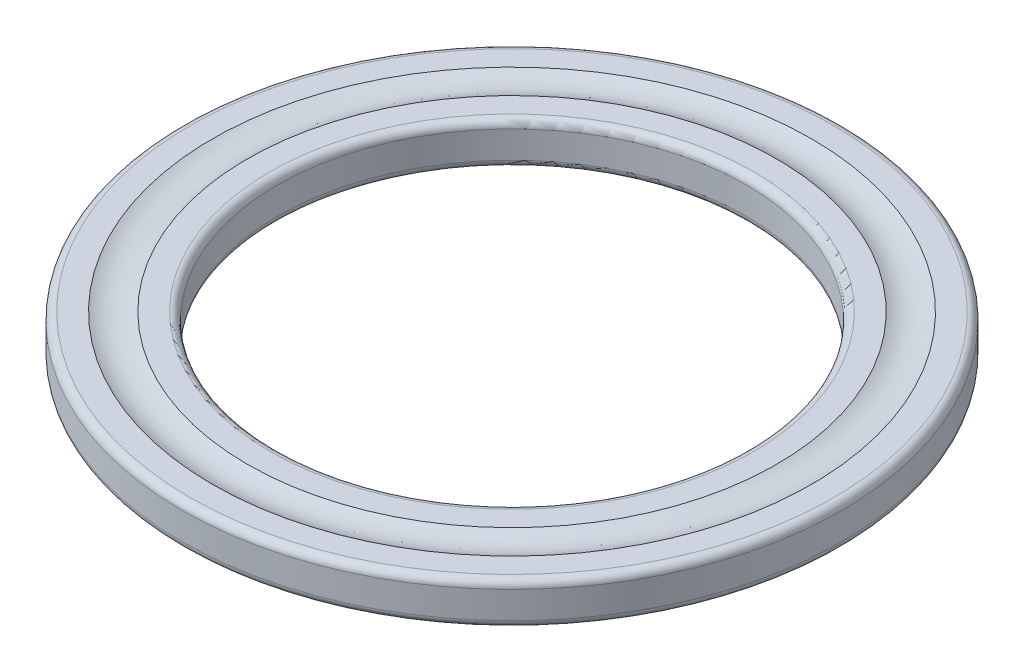
ISO-10303-21;
HEADER;
FILE_DESCRIPTION(('STEP AP214'),'2;1');
FILE_NAME('part.step','',(''),(''),'','','');
FILE_SCHEMA(('AUTOMOTIVE_DESIGN { 1 0 10303 214 1 1 1 1 }'));
ENDSEC;
DATA;
#1=APPLICATION_CONTEXT('core data for automotive mechanical design processes');
#2=APPLICATION_PROTOCOL_DEFINITION('international standard','automotive_design',2000,#1);
#3=PRODUCT_CONTEXT('',#1,'mechanical');
#4=PRODUCT('Part','Part','',(#3));
#5=PRODUCT_RELATED_PRODUCT_CATEGORY('part','',(#4));
#6=PRODUCT_DEFINITION_FORMATION('','',#4);
#7=PRODUCT_DEFINITION_CONTEXT('part definition',#1,'design');
#8=PRODUCT_DEFINITION('design','',#6,#7);
#9=PRODUCT_DEFINITION_SHAPE('','',#8);
#10=(LENGTH_UNIT() NAMED_UNIT(*) SI_UNIT(.MILLI.,.METRE.));
#11=(NAMED_UNIT(*) PLANE_ANGLE_UNIT() SI_UNIT($,.RADIAN.));
#12=(NAMED_UNIT(*) SI_UNIT($,.STERADIAN.) SOLID_ANGLE_UNIT());
#13=UNCERTAINTY_MEASURE_WITH_UNIT(LENGTH_MEASURE(1.E-05),#10,'distance_accuracy_value','');
#14=(GEOMETRIC_REPRESENTATION_CONTEXT(3) GLOBAL_UNCERTAINTY_ASSIGNED_CONTEXT((#13)) GLOBAL_UNIT_ASSIGNED_CONTEXT((#10,
#11,#12)) REPRESENTATION_CONTEXT('',''));
#15=CARTESIAN_POINT('',(0.,0.,0.));
#16=DIRECTION('',(0.,0.,1.));
#17=DIRECTION('',(1.,0.,0.));
#18=AXIS2_PLACEMENT_3D('',#15,#16,#17);
#19=CARTESIAN_POINT('',(0.,6.00000000000212,0.));
#20=DIRECTION('',(0.,1.,0.));
#21=DIRECTION('',(0.,0.,1.));
#22=AXIS2_PLACEMENT_3D('',#19,#20,#21);
#23=TOROIDAL_SURFACE('',#22,22.25,3.00000000000212);
#24=CARTESIAN_POINT('',(0.,3.3333333333333,0.));
#25=DIRECTION('',(0.,1.,0.));
#26=DIRECTION('',(0.,0.,1.));
#27=AXIS2_PLACEMENT_3D('',#24,#25,#26);
#28=CIRCLE('',#27,23.624368541873);
#29=CARTESIAN_POINT('',(0.,3.3333333333333,23.624368541873));
#30=VERTEX_POINT('',#29);
#31=EDGE_CURVE('E19',#30,#30,#28,.F.);
#32=ORIENTED_EDGE('',*,*,#31,.F.);
#33=EDGE_LOOP('',(#32));
#34=FACE_BOUND('',#33,.T.);
#35=CARTESIAN_POINT('',(0.,3.3333333333333,0.));
#36=DIRECTION('',(0.,1.,0.));
#37=DIRECTION('',(0.,0.,1.));
#38=AXIS2_PLACEMENT_3D('',#35,#36,#37);
#39=CIRCLE('',#38,20.875631458127);
#40=CARTESIAN_POINT('',(0.,3.3333333333333,20.875631458127));
#41=VERTEX_POINT('',#40);
#42=EDGE_CURVE('E143',#41,#41,#39,.T.);
#43=ORIENTED_EDGE('',*,*,#42,.F.);
#44=EDGE_LOOP('',(#43));
#45=FACE_BOUND('',#44,.T.);
#46=ADVANCED_FACE('F15',(#34,#45),#23,.F.);
#47=CARTESIAN_POINT('',(-23.624368541873,3.3333333333333,0.));
#48=DIRECTION('',(0.,1.,0.));
#49=DIRECTION('',(0.,0.,1.));
#50=AXIS2_PLACEMENT_3D('',#47,#48,#49);
#51=PLANE('',#50);
#52=ORIENTED_EDGE('',*,*,#31,.T.);
#53=EDGE_LOOP('',(#52));
#54=FACE_BOUND('',#53,.T.);
#55=CARTESIAN_POINT('',(0.,3.3333333333333,0.));
#56=DIRECTION('',(0.,-1.,0.));
#57=DIRECTION('',(0.,0.,-1.));
#58=AXIS2_PLACEMENT_3D('',#55,#56,#57);
#59=CIRCLE('',#58,25.4);
#60=CARTESIAN_POINT('',(0.,3.3333333333333,-25.4));
#61=VERTEX_POINT('',#60);
#62=EDGE_CURVE('E116',#61,#61,#59,.T.);
#63=ORIENTED_EDGE('',*,*,#62,.F.);
#64=EDGE_LOOP('',(#63));
#65=FACE_BOUND('',#64,.T.);
#66=ADVANCED_FACE('F121',(#54,#65),#51,.T.);
#67=CARTESIAN_POINT('',(-19.1,3.3333333333333,0.));
#68=DIRECTION('',(0.,1.,0.));
#69=DIRECTION('',(0.,0.,1.));
#70=AXIS2_PLACEMENT_3D('',#67,#68,#69);
#71=PLANE('',#70);
#72=CARTESIAN_POINT('',(0.,3.3333333333333,0.));
#73=DIRECTION('',(0.,1.,0.));
#74=DIRECTION('',(0.,0.,-1.));
#75=AXIS2_PLACEMENT_3D('',#72,#73,#74);
#76=CIRCLE('',#75,19.1);
#77=CARTESIAN_POINT('',(0.,3.3333333333333,-19.1));
#78=VERTEX_POINT('',#77);
#79=EDGE_CURVE('E85',#78,#78,#76,.T.);
#80=ORIENTED_EDGE('',*,*,#79,.F.);
#81=EDGE_LOOP('',(#80));
#82=FACE_BOUND('',#81,.T.);
#83=ORIENTED_EDGE('',*,*,#42,.T.);
#84=EDGE_LOOP('',(#83));
#85=FACE_BOUND('',#84,.T.);
#86=ADVANCED_FACE('F129',(#82,#85),#71,.T.);
#87=CARTESIAN_POINT('',(0.,2.73333333333355,0.));
#88=DIRECTION('',(0.,1.,0.));
#89=DIRECTION('',(0.,0.,1.));
#90=AXIS2_PLACEMENT_3D('',#87,#88,#89);
#91=TOROIDAL_SURFACE('',#90,25.4000000000002,0.599999999999754);
#92=CARTESIAN_POINT('',(0.,2.7333333333333,0.));
#93=DIRECTION('',(0.,1.,0.));
#94=DIRECTION('',(0.,0.,1.));
#95=AXIS2_PLACEMENT_3D('',#92,#93,#94);
#96=CIRCLE('',#95,26.);
#97=CARTESIAN_POINT('',(0.,2.7333333333333,26.));
#98=VERTEX_POINT('',#97);
#99=EDGE_CURVE('E82',#98,#98,#96,.F.);
#100=ORIENTED_EDGE('',*,*,#99,.F.);
#101=EDGE_LOOP('',(#100));
#102=FACE_BOUND('',#101,.T.);
#103=ORIENTED_EDGE('',*,*,#62,.T.);
#104=EDGE_LOOP('',(#103));
#105=FACE_BOUND('',#104,.T.);
#106=ADVANCED_FACE('F96',(#102,#105),#91,.T.);
#107=CARTESIAN_POINT('',(0.,2.73333333333355,0.));
#108=DIRECTION('',(0.,1.,0.));
#109=DIRECTION('',(0.,0.,1.));
#110=AXIS2_PLACEMENT_3D('',#107,#108,#109);
#111=TOROIDAL_SURFACE('',#110,19.0999999999998,0.599999999999754);
#112=ORIENTED_EDGE('',*,*,#79,.T.);
#113=EDGE_LOOP('',(#112));
#114=FACE_BOUND('',#113,.T.);
#115=CARTESIAN_POINT('',(0.,2.7333333333333,0.));
#116=DIRECTION('',(0.,1.,0.));
#117=DIRECTION('',(0.,0.,1.));
#118=AXIS2_PLACEMENT_3D('',#115,#116,#117);
#119=CIRCLE('',#118,18.5);
#120=CARTESIAN_POINT('',(0.,2.7333333333333,18.5));
#121=VERTEX_POINT('',#120);
#122=EDGE_CURVE('E38',#121,#121,#119,.F.);
#123=ORIENTED_EDGE('',*,*,#122,.T.);
#124=EDGE_LOOP('',(#123));
#125=FACE_BOUND('',#124,.T.);
#126=ADVANCED_FACE('F91',(#114,#125),#111,.T.);
#127=CARTESIAN_POINT('',(0.,1.66666666666665,0.));
#128=DIRECTION('',(0.,1.,0.));
#129=DIRECTION('',(0.,0.,1.));
#130=AXIS2_PLACEMENT_3D('',#127,#128,#129);
#131=CYLINDRICAL_SURFACE('',#130,26.);
#132=CARTESIAN_POINT('',(0.,0.599999999999873,0.));
#133=DIRECTION('',(0.,1.,0.));
#134=DIRECTION('',(0.,0.,1.));
#135=AXIS2_PLACEMENT_3D('',#132,#133,#134);
#136=CIRCLE('',#135,26.);
#137=CARTESIAN_POINT('',(0.,0.599999999999873,26.));
#138=VERTEX_POINT('',#137);
#139=EDGE_CURVE('E33',#138,#138,#136,.F.);
#140=ORIENTED_EDGE('',*,*,#139,.F.);
#141=EDGE_LOOP('',(#140));
#142=FACE_BOUND('',#141,.T.);
#143=ORIENTED_EDGE('',*,*,#99,.T.);
#144=EDGE_LOOP('',(#143));
#145=FACE_BOUND('',#144,.T.);
#146=ADVANCED_FACE('F95',(#142,#145),#131,.T.);
#147=CARTESIAN_POINT('',(0.,1.66666666666665,0.));
#148=DIRECTION('',(0.,1.,0.));
#149=DIRECTION('',(0.,0.,1.));
#150=AXIS2_PLACEMENT_3D('',#147,#148,#149);
#151=CYLINDRICAL_SURFACE('',#150,18.5);
#152=ORIENTED_EDGE('',*,*,#122,.F.);
#153=EDGE_LOOP('',(#152));
#154=FACE_BOUND('',#153,.T.);
#155=CARTESIAN_POINT('',(0.,0.6,0.));
#156=DIRECTION('',(0.,1.,0.));
#157=DIRECTION('',(0.,0.,1.));
#158=AXIS2_PLACEMENT_3D('',#155,#156,#157);
#159=CIRCLE('',#158,18.5);
#160=CARTESIAN_POINT('',(0.,0.6,18.5));
#161=VERTEX_POINT('',#160);
#162=EDGE_CURVE('E28',#161,#161,#159,.T.);
#163=ORIENTED_EDGE('',*,*,#162,.F.);
#164=EDGE_LOOP('',(#163));
#165=FACE_BOUND('',#164,.T.);
#166=ADVANCED_FACE('F67',(#154,#165),#151,.F.);
#167=CARTESIAN_POINT('',(0.,0.599999999999873,0.));
#168=DIRECTION('',(0.,1.,0.));
#169=DIRECTION('',(0.,0.,1.));
#170=AXIS2_PLACEMENT_3D('',#167,#168,#169);
#171=TOROIDAL_SURFACE('',#170,25.4000000000001,0.599999999999872);
#172=CARTESIAN_POINT('',(0.,0.,0.));
#173=DIRECTION('',(0.,1.,0.));
#174=DIRECTION('',(0.,0.,-1.));
#175=AXIS2_PLACEMENT_3D('',#172,#173,#174);
#176=CIRCLE('',#175,25.4);
#177=CARTESIAN_POINT('',(0.,0.,-25.4));
#178=VERTEX_POINT('',#177);
#179=EDGE_CURVE('E23',#178,#178,#176,.F.);
#180=ORIENTED_EDGE('',*,*,#179,.F.);
#181=EDGE_LOOP('',(#180));
#182=FACE_BOUND('',#181,.T.);
#183=ORIENTED_EDGE('',*,*,#139,.T.);
#184=EDGE_LOOP('',(#183));
#185=FACE_BOUND('',#184,.T.);
#186=ADVANCED_FACE('F62',(#182,#185),#171,.T.);
#187=CARTESIAN_POINT('',(0.,0.599999999999874,0.));
#188=DIRECTION('',(0.,1.,0.));
#189=DIRECTION('',(0.,0.,1.));
#190=AXIS2_PLACEMENT_3D('',#187,#188,#189);
#191=TOROIDAL_SURFACE('',#190,19.0999999999999,0.599999999999874);
#192=ORIENTED_EDGE('',*,*,#162,.T.);
#193=EDGE_LOOP('',(#192));
#194=FACE_BOUND('',#193,.T.);
#195=CARTESIAN_POINT('',(0.,0.,0.));
#196=DIRECTION('',(0.,-1.,0.));
#197=DIRECTION('',(0.,0.,-1.));
#198=AXIS2_PLACEMENT_3D('',#195,#196,#197);
#199=CIRCLE('',#198,19.1);
#200=CARTESIAN_POINT('',(0.,0.,-19.1));
#201=VERTEX_POINT('',#200);
#202=EDGE_CURVE('E10',#201,#201,#199,.F.);
#203=ORIENTED_EDGE('',*,*,#202,.F.);
#204=EDGE_LOOP('',(#203));
#205=FACE_BOUND('',#204,.T.);
#206=ADVANCED_FACE('F51',(#194,#205),#191,.T.);
#207=CARTESIAN_POINT('',(-25.4,0.,0.));
#208=DIRECTION('',(0.,-1.,0.));
#209=DIRECTION('',(0.,0.,-1.));
#210=AXIS2_PLACEMENT_3D('',#207,#208,#209);
#211=PLANE('',#210);
#212=ORIENTED_EDGE('',*,*,#202,.T.);
#213=EDGE_LOOP('',(#212));
#214=FACE_BOUND('',#213,.T.);
#215=ORIENTED_EDGE('',*,*,#179,.T.);
#216=EDGE_LOOP('',(#215));
#217=FACE_BOUND('',#216,.T.);
#218=ADVANCED_FACE('F61',(#214,#217),#211,.T.);
#219=CLOSED_SHELL('',(#46,#66,#86,#106,#126,#146,#166,#186,#206,#218));
#220=MANIFOLD_SOLID_BREP('B1',#219);
#221=ADVANCED_BREP_SHAPE_REPRESENTATION('',(#18,#220),#14);
#222=SHAPE_DEFINITION_REPRESENTATION(#9,#221);
ENDSEC;
END-ISO-10303-21;
